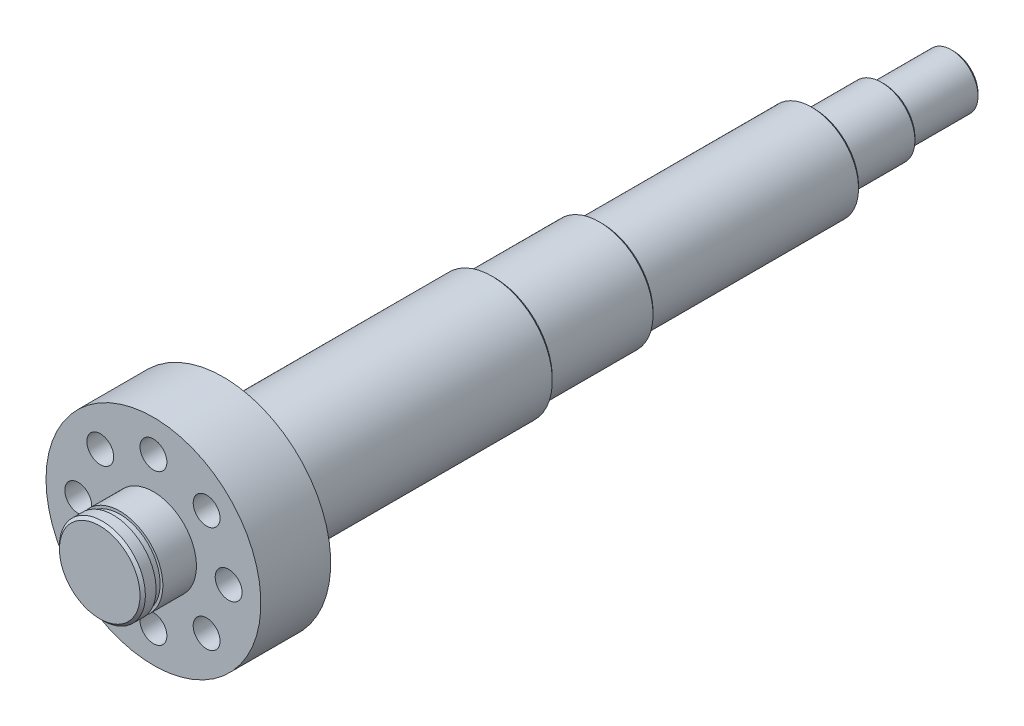
ISO-10303-21;
HEADER;
FILE_DESCRIPTION(('STEP AP214'),'2;1');
FILE_NAME('part.step','',(''),(''),'','','');
FILE_SCHEMA(('AUTOMOTIVE_DESIGN { 1 0 10303 214 1 1 1 1 }'));
ENDSEC;
DATA;
#1=APPLICATION_CONTEXT('core data for automotive mechanical design processes');
#2=APPLICATION_PROTOCOL_DEFINITION('international standard','automotive_design',2000,#1);
#3=PRODUCT_CONTEXT('',#1,'mechanical');
#4=PRODUCT('Part','Part','',(#3));
#5=PRODUCT_RELATED_PRODUCT_CATEGORY('part','',(#4));
#6=PRODUCT_DEFINITION_FORMATION('','',#4);
#7=PRODUCT_DEFINITION_CONTEXT('part definition',#1,'design');
#8=PRODUCT_DEFINITION('design','',#6,#7);
#9=PRODUCT_DEFINITION_SHAPE('','',#8);
#10=(LENGTH_UNIT() NAMED_UNIT(*) SI_UNIT(.MILLI.,.METRE.));
#11=(NAMED_UNIT(*) PLANE_ANGLE_UNIT() SI_UNIT($,.RADIAN.));
#12=(NAMED_UNIT(*) SI_UNIT($,.STERADIAN.) SOLID_ANGLE_UNIT());
#13=UNCERTAINTY_MEASURE_WITH_UNIT(LENGTH_MEASURE(1.E-05),#10,'distance_accuracy_value','');
#14=(GEOMETRIC_REPRESENTATION_CONTEXT(3) GLOBAL_UNCERTAINTY_ASSIGNED_CONTEXT((#13)) GLOBAL_UNIT_ASSIGNED_CONTEXT((#10,
#11,#12)) REPRESENTATION_CONTEXT('',''));
#15=CARTESIAN_POINT('',(0.,0.,0.));
#16=DIRECTION('',(0.,0.,1.));
#17=DIRECTION('',(1.,0.,0.));
#18=AXIS2_PLACEMENT_3D('',#15,#16,#17);
#19=CARTESIAN_POINT('',(0.,0.,-272.));
#20=DIRECTION('',(0.,0.,-1.));
#21=DIRECTION('',(-1.,0.,0.));
#22=AXIS2_PLACEMENT_3D('',#19,#20,#21);
#23=PLANE('',#22);
#24=CARTESIAN_POINT('',(0.,0.,-272.));
#25=DIRECTION('',(0.,0.,-1.));
#26=DIRECTION('',(-1.,0.,0.));
#27=AXIS2_PLACEMENT_3D('',#24,#25,#26);
#28=CIRCLE('',#27,11.5000000000001);
#29=CARTESIAN_POINT('',(-11.5000000000001,0.,-272.));
#30=VERTEX_POINT('',#29);
#31=EDGE_CURVE('E59',#30,#30,#28,.T.);
#32=ORIENTED_EDGE('',*,*,#31,.T.);
#33=EDGE_LOOP('',(#32));
#34=FACE_BOUND('',#33,.T.);
#35=CARTESIAN_POINT('',(0.,0.,-272.));
#36=DIRECTION('',(0.,0.,-1.));
#37=DIRECTION('',(-1.,0.,0.));
#38=AXIS2_PLACEMENT_3D('',#35,#36,#37);
#39=CIRCLE('',#38,10.);
#40=CARTESIAN_POINT('',(-10.,0.,-272.));
#41=VERTEX_POINT('',#40);
#42=EDGE_CURVE('E155',#41,#41,#39,.T.);
#43=ORIENTED_EDGE('',*,*,#42,.F.);
#44=EDGE_LOOP('',(#43));
#45=FACE_BOUND('',#44,.T.);
#46=ADVANCED_FACE('F30',(#34,#45),#23,.T.);
#47=CARTESIAN_POINT('',(0.,0.,-246.));
#48=DIRECTION('',(0.,0.,-1.));
#49=DIRECTION('',(-1.,0.,0.));
#50=AXIS2_PLACEMENT_3D('',#47,#48,#49);
#51=PLANE('',#50);
#52=CARTESIAN_POINT('',(0.,0.,-246.));
#53=DIRECTION('',(0.,0.,-1.));
#54=DIRECTION('',(-1.,0.,0.));
#55=AXIS2_PLACEMENT_3D('',#52,#53,#54);
#56=CIRCLE('',#55,16.5);
#57=CARTESIAN_POINT('',(-16.5,0.,-246.));
#58=VERTEX_POINT('',#57);
#59=EDGE_CURVE('E53',#58,#58,#56,.T.);
#60=ORIENTED_EDGE('',*,*,#59,.T.);
#61=EDGE_LOOP('',(#60));
#62=FACE_BOUND('',#61,.T.);
#63=CARTESIAN_POINT('',(0.,0.,-246.));
#64=DIRECTION('',(0.,0.,-1.));
#65=DIRECTION('',(-1.,0.,0.));
#66=AXIS2_PLACEMENT_3D('',#63,#64,#65);
#67=CIRCLE('',#66,12.5);
#68=CARTESIAN_POINT('',(-12.5,0.,-246.));
#69=VERTEX_POINT('',#68);
#70=EDGE_CURVE('E152',#69,#69,#67,.T.);
#71=ORIENTED_EDGE('',*,*,#70,.F.);
#72=EDGE_LOOP('',(#71));
#73=FACE_BOUND('',#72,.T.);
#74=ADVANCED_FACE('F203',(#62,#73),#51,.T.);
#75=CARTESIAN_POINT('',(0.,0.,-167.));
#76=DIRECTION('',(0.,0.,-1.));
#77=DIRECTION('',(-1.,0.,0.));
#78=AXIS2_PLACEMENT_3D('',#75,#76,#77);
#79=PLANE('',#78);
#80=CARTESIAN_POINT('',(0.,0.,-167.));
#81=DIRECTION('',(0.,0.,-1.));
#82=DIRECTION('',(-1.,0.,0.));
#83=AXIS2_PLACEMENT_3D('',#80,#81,#82);
#84=CIRCLE('',#83,19.);
#85=CARTESIAN_POINT('',(-19.,0.,-167.));
#86=VERTEX_POINT('',#85);
#87=EDGE_CURVE('E45',#86,#86,#84,.T.);
#88=ORIENTED_EDGE('',*,*,#87,.T.);
#89=EDGE_LOOP('',(#88));
#90=FACE_BOUND('',#89,.T.);
#91=CARTESIAN_POINT('',(0.,0.,-167.));
#92=DIRECTION('',(0.,0.,-1.));
#93=DIRECTION('',(-1.,0.,0.));
#94=AXIS2_PLACEMENT_3D('',#91,#92,#93);
#95=CIRCLE('',#94,17.5);
#96=CARTESIAN_POINT('',(-17.5,0.,-167.));
#97=VERTEX_POINT('',#96);
#98=EDGE_CURVE('E149',#97,#97,#95,.T.);
#99=ORIENTED_EDGE('',*,*,#98,.F.);
#100=EDGE_LOOP('',(#99));
#101=FACE_BOUND('',#100,.T.);
#102=ADVANCED_FACE('F209',(#90,#101),#79,.T.);
#103=CARTESIAN_POINT('',(0.,0.,-127.));
#104=DIRECTION('',(0.,0.,-1.));
#105=DIRECTION('',(-1.,0.,0.));
#106=AXIS2_PLACEMENT_3D('',#103,#104,#105);
#107=PLANE('',#106);
#108=CARTESIAN_POINT('',(0.,0.,-127.));
#109=DIRECTION('',(0.,0.,-1.));
#110=DIRECTION('',(-1.,0.,0.));
#111=AXIS2_PLACEMENT_3D('',#108,#109,#110);
#112=CIRCLE('',#111,21.4999999999999);
#113=CARTESIAN_POINT('',(-21.4999999999999,0.,-127.));
#114=VERTEX_POINT('',#113);
#115=EDGE_CURVE('E37',#114,#114,#112,.T.);
#116=ORIENTED_EDGE('',*,*,#115,.T.);
#117=EDGE_LOOP('',(#116));
#118=FACE_BOUND('',#117,.T.);
#119=CARTESIAN_POINT('',(0.,0.,-127.));
#120=DIRECTION('',(0.,0.,-1.));
#121=DIRECTION('',(-1.,0.,0.));
#122=AXIS2_PLACEMENT_3D('',#119,#120,#121);
#123=CIRCLE('',#122,20.);
#124=CARTESIAN_POINT('',(-20.,0.,-127.));
#125=VERTEX_POINT('',#124);
#126=EDGE_CURVE('E146',#125,#125,#123,.T.);
#127=ORIENTED_EDGE('',*,*,#126,.F.);
#128=EDGE_LOOP('',(#127));
#129=FACE_BOUND('',#128,.T.);
#130=ADVANCED_FACE('F226',(#118,#129),#107,.T.);
#131=CARTESIAN_POINT('',(0.,0.,-26.));
#132=DIRECTION('',(0.,0.,-1.));
#133=DIRECTION('',(-1.,0.,0.));
#134=AXIS2_PLACEMENT_3D('',#131,#132,#133);
#135=PLANE('',#134);
#136=CARTESIAN_POINT('',(0.,0.,-26.));
#137=DIRECTION('',(0.,0.,-1.));
#138=DIRECTION('',(-1.,0.,0.));
#139=AXIS2_PLACEMENT_3D('',#136,#137,#138);
#140=CIRCLE('',#139,40.);
#141=CARTESIAN_POINT('',(-40.,0.,-26.));
#142=VERTEX_POINT('',#141);
#143=EDGE_CURVE('E77',#142,#142,#140,.T.);
#144=ORIENTED_EDGE('',*,*,#143,.T.);
#145=EDGE_LOOP('',(#144));
#146=FACE_BOUND('',#145,.T.);
#147=CARTESIAN_POINT('',(0.,0.,-26.));
#148=DIRECTION('',(0.,0.,-1.));
#149=DIRECTION('',(-1.,0.,0.));
#150=AXIS2_PLACEMENT_3D('',#147,#148,#149);
#151=CIRCLE('',#150,22.5);
#152=CARTESIAN_POINT('',(-22.5,0.,-26.));
#153=VERTEX_POINT('',#152);
#154=EDGE_CURVE('E141',#153,#153,#151,.T.);
#155=ORIENTED_EDGE('',*,*,#154,.F.);
#156=EDGE_LOOP('',(#155));
#157=FACE_BOUND('',#156,.T.);
#158=ADVANCED_FACE('F234',(#146,#157),#135,.T.);
#159=CARTESIAN_POINT('',(0.,0.,20.));
#160=DIRECTION('',(0.,0.,-1.));
#161=DIRECTION('',(-1.,0.,0.));
#162=AXIS2_PLACEMENT_3D('',#159,#160,#161);
#163=CYLINDRICAL_SURFACE('',#162,16.);
#164=CARTESIAN_POINT('',(0.,0.,0.));
#165=DIRECTION('',(0.,0.,-1.));
#166=DIRECTION('',(-1.,0.,0.));
#167=AXIS2_PLACEMENT_3D('',#164,#165,#166);
#168=CIRCLE('',#167,16.);
#169=CARTESIAN_POINT('',(-16.,0.,0.));
#170=VERTEX_POINT('',#169);
#171=EDGE_CURVE('E74',#170,#170,#168,.T.);
#172=ORIENTED_EDGE('',*,*,#171,.F.);
#173=EDGE_LOOP('',(#172));
#174=FACE_BOUND('',#173,.T.);
#175=CARTESIAN_POINT('',(0.,0.,12.5));
#176=DIRECTION('',(0.,0.,-1.));
#177=DIRECTION('',(-1.,0.,0.));
#178=AXIS2_PLACEMENT_3D('',#175,#176,#177);
#179=CIRCLE('',#178,16.);
#180=CARTESIAN_POINT('',(-16.,0.,12.5));
#181=VERTEX_POINT('',#180);
#182=EDGE_CURVE('E92',#181,#181,#179,.T.);
#183=ORIENTED_EDGE('',*,*,#182,.T.);
#184=EDGE_LOOP('',(#183));
#185=FACE_BOUND('',#184,.T.);
#186=ADVANCED_FACE('F319',(#174,#185),#163,.T.);
#187=CARTESIAN_POINT('',(0.,0.,0.));
#188=DIRECTION('',(0.,0.,-1.));
#189=DIRECTION('',(-1.,0.,0.));
#190=AXIS2_PLACEMENT_3D('',#187,#188,#189);
#191=PLANE('',#190);
#192=CARTESIAN_POINT('',(19.7989898732236,-19.7989898732231,0.));
#193=DIRECTION('',(0.,0.,1.));
#194=DIRECTION('',(0.707106781186556,-0.707106781186539,0.));
#195=AXIS2_PLACEMENT_3D('',#192,#193,#194);
#196=CIRCLE('',#195,5.);
#197=CARTESIAN_POINT('',(23.3345237791564,-23.3345237791558,0.));
#198=VERTEX_POINT('',#197);
#199=EDGE_CURVE('E138',#198,#198,#196,.T.);
#200=ORIENTED_EDGE('',*,*,#199,.F.);
#201=EDGE_LOOP('',(#200));
#202=FACE_BOUND('',#201,.T.);
#203=CARTESIAN_POINT('',(2.93284602333188E-13,-28.,0.));
#204=DIRECTION('',(0.,0.,1.));
#205=DIRECTION('',(0.,-1.,0.));
#206=AXIS2_PLACEMENT_3D('',#203,#204,#205);
#207=CIRCLE('',#206,5.);
#208=CARTESIAN_POINT('',(3.45656852749829E-13,-33.,0.));
#209=VERTEX_POINT('',#208);
#210=EDGE_CURVE('E132',#209,#209,#207,.T.);
#211=ORIENTED_EDGE('',*,*,#210,.F.);
#212=EDGE_LOOP('',(#211));
#213=FACE_BOUND('',#212,.T.);
#214=CARTESIAN_POINT('',(-19.7989898732232,-19.7989898732235,0.));
#215=DIRECTION('',(0.,0.,1.));
#216=DIRECTION('',(-0.707106781186541,-0.707106781186554,0.));
#217=AXIS2_PLACEMENT_3D('',#214,#215,#216);
#218=CIRCLE('',#217,5.);
#219=CARTESIAN_POINT('',(-23.3345237791559,-23.3345237791563,0.));
#220=VERTEX_POINT('',#219);
#221=EDGE_CURVE('E126',#220,#220,#218,.T.);
#222=ORIENTED_EDGE('',*,*,#221,.F.);
#223=EDGE_LOOP('',(#222));
#224=FACE_BOUND('',#223,.T.);
#225=CARTESIAN_POINT('',(-28.,0.,0.));
#226=DIRECTION('',(0.,0.,1.));
#227=DIRECTION('',(-1.,0.,0.));
#228=AXIS2_PLACEMENT_3D('',#225,#226,#227);
#229=CIRCLE('',#228,5.);
#230=CARTESIAN_POINT('',(-33.,0.,0.));
#231=VERTEX_POINT('',#230);
#232=EDGE_CURVE('E120',#231,#231,#229,.T.);
#233=ORIENTED_EDGE('',*,*,#232,.F.);
#234=EDGE_LOOP('',(#233));
#235=FACE_BOUND('',#234,.T.);
#236=CARTESIAN_POINT('',(-19.7989898732234,19.7989898732232,0.));
#237=DIRECTION('',(0.,0.,1.));
#238=DIRECTION('',(-0.707106781186551,0.707106781186544,0.));
#239=AXIS2_PLACEMENT_3D('',#236,#237,#238);
#240=CIRCLE('',#239,5.);
#241=CARTESIAN_POINT('',(-23.3345237791562,23.3345237791559,0.));
#242=VERTEX_POINT('',#241);
#243=EDGE_CURVE('E114',#242,#242,#240,.T.);
#244=ORIENTED_EDGE('',*,*,#243,.F.);
#245=EDGE_LOOP('',(#244));
#246=FACE_BOUND('',#245,.T.);
#247=CARTESIAN_POINT('',(0.,28.,0.));
#248=DIRECTION('',(0.,0.,1.));
#249=DIRECTION('',(0.,1.,0.));
#250=AXIS2_PLACEMENT_3D('',#247,#248,#249);
#251=CIRCLE('',#250,5.);
#252=CARTESIAN_POINT('',(-1.1521895091661E-13,33.,0.));
#253=VERTEX_POINT('',#252);
#254=EDGE_CURVE('E108',#253,#253,#251,.T.);
#255=ORIENTED_EDGE('',*,*,#254,.F.);
#256=EDGE_LOOP('',(#255));
#257=FACE_BOUND('',#256,.T.);
#258=CARTESIAN_POINT('',(19.7989898732233,19.7989898732234,0.));
#259=DIRECTION('',(0.,0.,1.));
#260=DIRECTION('',(0.707106781186546,0.707106781186549,0.));
#261=AXIS2_PLACEMENT_3D('',#258,#259,#260);
#262=CIRCLE('',#261,5.);
#263=CARTESIAN_POINT('',(23.334523779156,23.3345237791561,0.));
#264=VERTEX_POINT('',#263);
#265=EDGE_CURVE('E102',#264,#264,#262,.T.);
#266=ORIENTED_EDGE('',*,*,#265,.F.);
#267=EDGE_LOOP('',(#266));
#268=FACE_BOUND('',#267,.T.);
#269=CARTESIAN_POINT('',(28.,0.,0.));
#270=DIRECTION('',(0.,0.,1.));
#271=DIRECTION('',(1.,0.,0.));
#272=AXIS2_PLACEMENT_3D('',#269,#270,#271);
#273=CIRCLE('',#272,5.);
#274=CARTESIAN_POINT('',(33.,0.,0.));
#275=VERTEX_POINT('',#274);
#276=EDGE_CURVE('E96',#275,#275,#273,.T.);
#277=ORIENTED_EDGE('',*,*,#276,.F.);
#278=EDGE_LOOP('',(#277));
#279=FACE_BOUND('',#278,.T.);
#280=CARTESIAN_POINT('',(0.,0.,0.));
#281=DIRECTION('',(0.,0.,-1.));
#282=DIRECTION('',(-1.,0.,0.));
#283=AXIS2_PLACEMENT_3D('',#280,#281,#282);
#284=CIRCLE('',#283,40.);
#285=CARTESIAN_POINT('',(-40.,0.,0.));
#286=VERTEX_POINT('',#285);
#287=EDGE_CURVE('E78',#286,#286,#284,.T.);
#288=ORIENTED_EDGE('',*,*,#287,.F.);
#289=EDGE_LOOP('',(#288));
#290=FACE_BOUND('',#289,.T.);
#291=ORIENTED_EDGE('',*,*,#171,.T.);
#292=EDGE_LOOP('',(#291));
#293=FACE_BOUND('',#292,.T.);
#294=ADVANCED_FACE('F321',(#202,#213,#224,#235,#246,#257,#268,#279,#290,#293),#191,.F.);
#295=CARTESIAN_POINT('',(0.,0.,-26.));
#296=DIRECTION('',(0.,0.,1.));
#297=DIRECTION('',(1.,0.,0.));
#298=AXIS2_PLACEMENT_3D('',#295,#296,#297);
#299=CYLINDRICAL_SURFACE('',#298,40.);
#300=ORIENTED_EDGE('',*,*,#143,.F.);
#301=EDGE_LOOP('',(#300));
#302=FACE_BOUND('',#301,.T.);
#303=ORIENTED_EDGE('',*,*,#287,.T.);
#304=EDGE_LOOP('',(#303));
#305=FACE_BOUND('',#304,.T.);
#306=ADVANCED_FACE('F315',(#302,#305),#299,.T.);
#307=CARTESIAN_POINT('',(16.,0.,15.));
#308=DIRECTION('',(0.,0.,-1.));
#309=DIRECTION('',(-1.,0.,0.));
#310=AXIS2_PLACEMENT_3D('',#307,#308,#309);
#311=PLANE('',#310);
#312=CARTESIAN_POINT('',(0.,0.,15.));
#313=DIRECTION('',(0.,0.,-1.));
#314=DIRECTION('',(-1.,0.,0.));
#315=AXIS2_PLACEMENT_3D('',#312,#313,#314);
#316=CIRCLE('',#315,16.);
#317=CARTESIAN_POINT('',(-16.,0.,15.));
#318=VERTEX_POINT('',#317);
#319=EDGE_CURVE('E81',#318,#318,#316,.T.);
#320=ORIENTED_EDGE('',*,*,#319,.T.);
#321=EDGE_LOOP('',(#320));
#322=FACE_BOUND('',#321,.T.);
#323=CARTESIAN_POINT('',(0.,0.,15.));
#324=DIRECTION('',(0.,0.,-1.));
#325=DIRECTION('',(-1.,0.,0.));
#326=AXIS2_PLACEMENT_3D('',#323,#324,#325);
#327=CIRCLE('',#326,15.);
#328=CARTESIAN_POINT('',(-15.,0.,15.));
#329=VERTEX_POINT('',#328);
#330=EDGE_CURVE('E86',#329,#329,#327,.T.);
#331=ORIENTED_EDGE('',*,*,#330,.F.);
#332=EDGE_LOOP('',(#331));
#333=FACE_BOUND('',#332,.T.);
#334=ADVANCED_FACE('F311',(#322,#333),#311,.T.);
#335=CARTESIAN_POINT('',(0.,0.,0.));
#336=DIRECTION('',(0.,0.,-1.));
#337=DIRECTION('',(-1.,0.,0.));
#338=AXIS2_PLACEMENT_3D('',#335,#336,#337);
#339=CYLINDRICAL_SURFACE('',#338,15.);
#340=ORIENTED_EDGE('',*,*,#330,.T.);
#341=EDGE_LOOP('',(#340));
#342=FACE_BOUND('',#341,.T.);
#343=CARTESIAN_POINT('',(0.,0.,12.5));
#344=DIRECTION('',(0.,0.,-1.));
#345=DIRECTION('',(-1.,0.,0.));
#346=AXIS2_PLACEMENT_3D('',#343,#344,#345);
#347=CIRCLE('',#346,15.);
#348=CARTESIAN_POINT('',(-15.,0.,12.5));
#349=VERTEX_POINT('',#348);
#350=EDGE_CURVE('E89',#349,#349,#347,.T.);
#351=ORIENTED_EDGE('',*,*,#350,.F.);
#352=EDGE_LOOP('',(#351));
#353=FACE_BOUND('',#352,.T.);
#354=ADVANCED_FACE('F307',(#342,#353),#339,.T.);
#355=CARTESIAN_POINT('',(16.,0.,12.5));
#356=DIRECTION('',(0.,0.,1.));
#357=DIRECTION('',(1.,0.,0.));
#358=AXIS2_PLACEMENT_3D('',#355,#356,#357);
#359=PLANE('',#358);
#360=ORIENTED_EDGE('',*,*,#350,.T.);
#361=EDGE_LOOP('',(#360));
#362=FACE_BOUND('',#361,.T.);
#363=ORIENTED_EDGE('',*,*,#182,.F.);
#364=EDGE_LOOP('',(#363));
#365=FACE_BOUND('',#364,.T.);
#366=ADVANCED_FACE('F303',(#362,#365),#359,.T.);
#367=CARTESIAN_POINT('',(0.,0.,20.));
#368=DIRECTION('',(0.,0.,1.));
#369=DIRECTION('',(1.,0.,0.));
#370=AXIS2_PLACEMENT_3D('',#367,#368,#369);
#371=PLANE('',#370);
#372=CARTESIAN_POINT('',(0.,0.,20.));
#373=DIRECTION('',(0.,0.,1.));
#374=DIRECTION('',(1.,0.,0.));
#375=AXIS2_PLACEMENT_3D('',#372,#373,#374);
#376=CIRCLE('',#375,15.);
#377=CARTESIAN_POINT('',(15.,0.,20.));
#378=VERTEX_POINT('',#377);
#379=EDGE_CURVE('E71',#378,#378,#376,.T.);
#380=ORIENTED_EDGE('',*,*,#379,.T.);
#381=EDGE_LOOP('',(#380));
#382=FACE_BOUND('',#381,.T.);
#383=ADVANCED_FACE('F306',(#382),#371,.T.);
#384=CARTESIAN_POINT('',(0.,0.,19.));
#385=DIRECTION('',(0.,0.,1.));
#386=DIRECTION('',(1.,0.,0.));
#387=AXIS2_PLACEMENT_3D('',#384,#385,#386);
#388=CIRCLE('',#387,16.);
#389=CARTESIAN_POINT('',(16.,0.,19.));
#390=VERTEX_POINT('',#389);
#391=EDGE_CURVE('E68',#390,#390,#388,.F.);
#392=ORIENTED_EDGE('',*,*,#391,.T.);
#393=EDGE_LOOP('',(#392));
#394=FACE_BOUND('',#393,.T.);
#395=ORIENTED_EDGE('',*,*,#319,.F.);
#396=EDGE_LOOP('',(#395));
#397=FACE_BOUND('',#396,.T.);
#398=ADVANCED_FACE('F301',(#394,#397),#163,.T.);
#399=CARTESIAN_POINT('',(28.,0.,-8.));
#400=DIRECTION('',(0.,0.,1.));
#401=DIRECTION('',(1.,0.,0.));
#402=AXIS2_PLACEMENT_3D('',#399,#400,#401);
#403=CYLINDRICAL_SURFACE('',#402,5.);
#404=CARTESIAN_POINT('',(28.,0.,-8.));
#405=DIRECTION('',(0.,0.,1.));
#406=DIRECTION('',(1.,0.,0.));
#407=AXIS2_PLACEMENT_3D('',#404,#405,#406);
#408=CIRCLE('',#407,5.);
#409=CARTESIAN_POINT('',(33.,0.,-8.));
#410=VERTEX_POINT('',#409);
#411=EDGE_CURVE('E95',#410,#410,#408,.T.);
#412=ORIENTED_EDGE('',*,*,#411,.F.);
#413=EDGE_LOOP('',(#412));
#414=FACE_BOUND('',#413,.T.);
#415=ORIENTED_EDGE('',*,*,#276,.T.);
#416=EDGE_LOOP('',(#415));
#417=FACE_BOUND('',#416,.T.);
#418=ADVANCED_FACE('F297',(#414,#417),#403,.F.);
#419=CARTESIAN_POINT('',(28.,0.,-8.));
#420=DIRECTION('',(0.,0.,1.));
#421=DIRECTION('',(1.,0.,0.));
#422=AXIS2_PLACEMENT_3D('',#419,#420,#421);
#423=PLANE('',#422);
#424=ORIENTED_EDGE('',*,*,#411,.T.);
#425=EDGE_LOOP('',(#424));
#426=FACE_BOUND('',#425,.T.);
#427=ADVANCED_FACE('F293',(#426),#423,.T.);
#428=CARTESIAN_POINT('',(19.7989898732233,19.7989898732234,-8.));
#429=DIRECTION('',(0.,0.,1.));
#430=DIRECTION('',(1.,0.,0.));
#431=AXIS2_PLACEMENT_3D('',#428,#429,#430);
#432=CYLINDRICAL_SURFACE('',#431,5.);
#433=CARTESIAN_POINT('',(19.7989898732233,19.7989898732234,-8.));
#434=DIRECTION('',(0.,0.,1.));
#435=DIRECTION('',(0.707106781186546,0.707106781186549,0.));
#436=AXIS2_PLACEMENT_3D('',#433,#434,#435);
#437=CIRCLE('',#436,5.);
#438=CARTESIAN_POINT('',(23.334523779156,23.3345237791561,-8.));
#439=VERTEX_POINT('',#438);
#440=EDGE_CURVE('E99',#439,#439,#437,.T.);
#441=ORIENTED_EDGE('',*,*,#440,.F.);
#442=EDGE_LOOP('',(#441));
#443=FACE_BOUND('',#442,.T.);
#444=ORIENTED_EDGE('',*,*,#265,.T.);
#445=EDGE_LOOP('',(#444));
#446=FACE_BOUND('',#445,.T.);
#447=ADVANCED_FACE('F289',(#443,#446),#432,.F.);
#448=CARTESIAN_POINT('',(19.7989898732233,19.7989898732234,-8.));
#449=DIRECTION('',(0.,0.,1.));
#450=DIRECTION('',(0.707106781186546,0.707106781186549,0.));
#451=AXIS2_PLACEMENT_3D('',#448,#449,#450);
#452=PLANE('',#451);
#453=ORIENTED_EDGE('',*,*,#440,.T.);
#454=EDGE_LOOP('',(#453));
#455=FACE_BOUND('',#454,.T.);
#456=ADVANCED_FACE('F285',(#455),#452,.T.);
#457=CARTESIAN_POINT('',(0.,28.,-8.));
#458=DIRECTION('',(0.,0.,1.));
#459=DIRECTION('',(1.,0.,0.));
#460=AXIS2_PLACEMENT_3D('',#457,#458,#459);
#461=CYLINDRICAL_SURFACE('',#460,5.);
#462=CARTESIAN_POINT('',(0.,28.,-8.));
#463=DIRECTION('',(0.,0.,1.));
#464=DIRECTION('',(0.,1.,0.));
#465=AXIS2_PLACEMENT_3D('',#462,#463,#464);
#466=CIRCLE('',#465,5.);
#467=CARTESIAN_POINT('',(-1.1521895091661E-13,33.,-8.));
#468=VERTEX_POINT('',#467);
#469=EDGE_CURVE('E105',#468,#468,#466,.T.);
#470=ORIENTED_EDGE('',*,*,#469,.F.);
#471=EDGE_LOOP('',(#470));
#472=FACE_BOUND('',#471,.T.);
#473=ORIENTED_EDGE('',*,*,#254,.T.);
#474=EDGE_LOOP('',(#473));
#475=FACE_BOUND('',#474,.T.);
#476=ADVANCED_FACE('F281',(#472,#475),#461,.F.);
#477=CARTESIAN_POINT('',(0.,28.,-8.));
#478=DIRECTION('',(0.,0.,1.));
#479=DIRECTION('',(0.,1.,0.));
#480=AXIS2_PLACEMENT_3D('',#477,#478,#479);
#481=PLANE('',#480);
#482=ORIENTED_EDGE('',*,*,#469,.T.);
#483=EDGE_LOOP('',(#482));
#484=FACE_BOUND('',#483,.T.);
#485=ADVANCED_FACE('F277',(#484),#481,.T.);
#486=CARTESIAN_POINT('',(-19.7989898732234,19.7989898732232,-8.));
#487=DIRECTION('',(0.,0.,1.));
#488=DIRECTION('',(1.,0.,0.));
#489=AXIS2_PLACEMENT_3D('',#486,#487,#488);
#490=CYLINDRICAL_SURFACE('',#489,5.);
#491=CARTESIAN_POINT('',(-19.7989898732234,19.7989898732232,-8.));
#492=DIRECTION('',(0.,0.,1.));
#493=DIRECTION('',(-0.707106781186551,0.707106781186544,0.));
#494=AXIS2_PLACEMENT_3D('',#491,#492,#493);
#495=CIRCLE('',#494,5.);
#496=CARTESIAN_POINT('',(-23.3345237791562,23.3345237791559,-8.));
#497=VERTEX_POINT('',#496);
#498=EDGE_CURVE('E111',#497,#497,#495,.T.);
#499=ORIENTED_EDGE('',*,*,#498,.F.);
#500=EDGE_LOOP('',(#499));
#501=FACE_BOUND('',#500,.T.);
#502=ORIENTED_EDGE('',*,*,#243,.T.);
#503=EDGE_LOOP('',(#502));
#504=FACE_BOUND('',#503,.T.);
#505=ADVANCED_FACE('F273',(#501,#504),#490,.F.);
#506=CARTESIAN_POINT('',(-19.7989898732234,19.7989898732232,-8.));
#507=DIRECTION('',(0.,0.,1.));
#508=DIRECTION('',(-0.707106781186551,0.707106781186544,0.));
#509=AXIS2_PLACEMENT_3D('',#506,#507,#508);
#510=PLANE('',#509);
#511=ORIENTED_EDGE('',*,*,#498,.T.);
#512=EDGE_LOOP('',(#511));
#513=FACE_BOUND('',#512,.T.);
#514=ADVANCED_FACE('F269',(#513),#510,.T.);
#515=CARTESIAN_POINT('',(-28.,0.,-8.));
#516=DIRECTION('',(0.,0.,1.));
#517=DIRECTION('',(1.,0.,0.));
#518=AXIS2_PLACEMENT_3D('',#515,#516,#517);
#519=CYLINDRICAL_SURFACE('',#518,5.);
#520=CARTESIAN_POINT('',(-28.,0.,-8.));
#521=DIRECTION('',(0.,0.,1.));
#522=DIRECTION('',(-1.,0.,0.));
#523=AXIS2_PLACEMENT_3D('',#520,#521,#522);
#524=CIRCLE('',#523,5.);
#525=CARTESIAN_POINT('',(-33.,0.,-8.));
#526=VERTEX_POINT('',#525);
#527=EDGE_CURVE('E117',#526,#526,#524,.T.);
#528=ORIENTED_EDGE('',*,*,#527,.F.);
#529=EDGE_LOOP('',(#528));
#530=FACE_BOUND('',#529,.T.);
#531=ORIENTED_EDGE('',*,*,#232,.T.);
#532=EDGE_LOOP('',(#531));
#533=FACE_BOUND('',#532,.T.);
#534=ADVANCED_FACE('F265',(#530,#533),#519,.F.);
#535=CARTESIAN_POINT('',(-28.,0.,-8.));
#536=DIRECTION('',(0.,0.,1.));
#537=DIRECTION('',(-1.,0.,0.));
#538=AXIS2_PLACEMENT_3D('',#535,#536,#537);
#539=PLANE('',#538);
#540=ORIENTED_EDGE('',*,*,#527,.T.);
#541=EDGE_LOOP('',(#540));
#542=FACE_BOUND('',#541,.T.);
#543=ADVANCED_FACE('F261',(#542),#539,.T.);
#544=CARTESIAN_POINT('',(-19.7989898732232,-19.7989898732235,-8.));
#545=DIRECTION('',(0.,0.,1.));
#546=DIRECTION('',(1.,0.,0.));
#547=AXIS2_PLACEMENT_3D('',#544,#545,#546);
#548=CYLINDRICAL_SURFACE('',#547,5.);
#549=CARTESIAN_POINT('',(-19.7989898732232,-19.7989898732235,-8.));
#550=DIRECTION('',(0.,0.,1.));
#551=DIRECTION('',(-0.707106781186541,-0.707106781186554,0.));
#552=AXIS2_PLACEMENT_3D('',#549,#550,#551);
#553=CIRCLE('',#552,5.);
#554=CARTESIAN_POINT('',(-23.3345237791559,-23.3345237791563,-8.));
#555=VERTEX_POINT('',#554);
#556=EDGE_CURVE('E123',#555,#555,#553,.T.);
#557=ORIENTED_EDGE('',*,*,#556,.F.);
#558=EDGE_LOOP('',(#557));
#559=FACE_BOUND('',#558,.T.);
#560=ORIENTED_EDGE('',*,*,#221,.T.);
#561=EDGE_LOOP('',(#560));
#562=FACE_BOUND('',#561,.T.);
#563=ADVANCED_FACE('F257',(#559,#562),#548,.F.);
#564=CARTESIAN_POINT('',(-19.7989898732232,-19.7989898732235,-8.));
#565=DIRECTION('',(0.,0.,1.));
#566=DIRECTION('',(-0.707106781186541,-0.707106781186554,0.));
#567=AXIS2_PLACEMENT_3D('',#564,#565,#566);
#568=PLANE('',#567);
#569=ORIENTED_EDGE('',*,*,#556,.T.);
#570=EDGE_LOOP('',(#569));
#571=FACE_BOUND('',#570,.T.);
#572=ADVANCED_FACE('F253',(#571),#568,.T.);
#573=CARTESIAN_POINT('',(2.93284602333188E-13,-28.,-8.));
#574=DIRECTION('',(0.,0.,1.));
#575=DIRECTION('',(1.,0.,0.));
#576=AXIS2_PLACEMENT_3D('',#573,#574,#575);
#577=CYLINDRICAL_SURFACE('',#576,5.);
#578=CARTESIAN_POINT('',(2.93284602333188E-13,-28.,-8.));
#579=DIRECTION('',(0.,0.,1.));
#580=DIRECTION('',(0.,-1.,0.));
#581=AXIS2_PLACEMENT_3D('',#578,#579,#580);
#582=CIRCLE('',#581,5.);
#583=CARTESIAN_POINT('',(3.45656852749829E-13,-33.,-8.));
#584=VERTEX_POINT('',#583);
#585=EDGE_CURVE('E129',#584,#584,#582,.T.);
#586=ORIENTED_EDGE('',*,*,#585,.F.);
#587=EDGE_LOOP('',(#586));
#588=FACE_BOUND('',#587,.T.);
#589=ORIENTED_EDGE('',*,*,#210,.T.);
#590=EDGE_LOOP('',(#589));
#591=FACE_BOUND('',#590,.T.);
#592=ADVANCED_FACE('F249',(#588,#591),#577,.F.);
#593=CARTESIAN_POINT('',(2.93284602333188E-13,-28.,-8.));
#594=DIRECTION('',(0.,0.,1.));
#595=DIRECTION('',(0.,-1.,0.));
#596=AXIS2_PLACEMENT_3D('',#593,#594,#595);
#597=PLANE('',#596);
#598=ORIENTED_EDGE('',*,*,#585,.T.);
#599=EDGE_LOOP('',(#598));
#600=FACE_BOUND('',#599,.T.);
#601=ADVANCED_FACE('F245',(#600),#597,.T.);
#602=CARTESIAN_POINT('',(19.7989898732236,-19.7989898732231,-8.));
#603=DIRECTION('',(0.,0.,1.));
#604=DIRECTION('',(1.,0.,0.));
#605=AXIS2_PLACEMENT_3D('',#602,#603,#604);
#606=CYLINDRICAL_SURFACE('',#605,5.);
#607=CARTESIAN_POINT('',(19.7989898732236,-19.7989898732231,-8.));
#608=DIRECTION('',(0.,0.,1.));
#609=DIRECTION('',(0.707106781186556,-0.707106781186539,0.));
#610=AXIS2_PLACEMENT_3D('',#607,#608,#609);
#611=CIRCLE('',#610,5.);
#612=CARTESIAN_POINT('',(23.3345237791564,-23.3345237791558,-8.));
#613=VERTEX_POINT('',#612);
#614=EDGE_CURVE('E135',#613,#613,#611,.T.);
#615=ORIENTED_EDGE('',*,*,#614,.F.);
#616=EDGE_LOOP('',(#615));
#617=FACE_BOUND('',#616,.T.);
#618=ORIENTED_EDGE('',*,*,#199,.T.);
#619=EDGE_LOOP('',(#618));
#620=FACE_BOUND('',#619,.T.);
#621=ADVANCED_FACE('F241',(#617,#620),#606,.F.);
#622=CARTESIAN_POINT('',(19.7989898732236,-19.7989898732231,-8.));
#623=DIRECTION('',(0.,0.,1.));
#624=DIRECTION('',(0.707106781186556,-0.707106781186539,0.));
#625=AXIS2_PLACEMENT_3D('',#622,#623,#624);
#626=PLANE('',#625);
#627=ORIENTED_EDGE('',*,*,#614,.T.);
#628=EDGE_LOOP('',(#627));
#629=FACE_BOUND('',#628,.T.);
#630=ADVANCED_FACE('F238',(#629),#626,.T.);
#631=CARTESIAN_POINT('',(0.,0.,20.));
#632=DIRECTION('',(0.,0.,-1.));
#633=DIRECTION('',(-1.,0.,0.));
#634=AXIS2_PLACEMENT_3D('',#631,#632,#633);
#635=CONICAL_SURFACE('',#634,15.,0.785398163397443);
#636=ORIENTED_EDGE('',*,*,#391,.F.);
#637=EDGE_LOOP('',(#636));
#638=FACE_BOUND('',#637,.T.);
#639=ORIENTED_EDGE('',*,*,#379,.F.);
#640=EDGE_LOOP('',(#639));
#641=FACE_BOUND('',#640,.T.);
#642=ADVANCED_FACE('F237',(#638,#641),#635,.T.);
#643=CARTESIAN_POINT('',(0.,0.,-127.));
#644=DIRECTION('',(0.,0.,1.));
#645=DIRECTION('',(1.,0.,0.));
#646=AXIS2_PLACEMENT_3D('',#643,#644,#645);
#647=CYLINDRICAL_SURFACE('',#646,22.5);
#648=CARTESIAN_POINT('',(0.,0.,-126.));
#649=DIRECTION('',(0.,0.,-1.));
#650=DIRECTION('',(-1.,0.,0.));
#651=AXIS2_PLACEMENT_3D('',#648,#649,#650);
#652=CIRCLE('',#651,22.5);
#653=CARTESIAN_POINT('',(-22.5,0.,-126.));
#654=VERTEX_POINT('',#653);
#655=EDGE_CURVE('E10',#654,#654,#652,.F.);
#656=ORIENTED_EDGE('',*,*,#655,.T.);
#657=EDGE_LOOP('',(#656));
#658=FACE_BOUND('',#657,.T.);
#659=ORIENTED_EDGE('',*,*,#154,.T.);
#660=EDGE_LOOP('',(#659));
#661=FACE_BOUND('',#660,.T.);
#662=ADVANCED_FACE('F230',(#658,#661),#647,.T.);
#663=CARTESIAN_POINT('',(0.,0.,-167.));
#664=DIRECTION('',(0.,0.,1.));
#665=DIRECTION('',(1.,0.,0.));
#666=AXIS2_PLACEMENT_3D('',#663,#664,#665);
#667=CYLINDRICAL_SURFACE('',#666,20.);
#668=CARTESIAN_POINT('',(0.,0.,-166.));
#669=DIRECTION('',(0.,0.,-1.));
#670=DIRECTION('',(-1.,0.,0.));
#671=AXIS2_PLACEMENT_3D('',#668,#669,#670);
#672=CIRCLE('',#671,20.);
#673=CARTESIAN_POINT('',(-20.,0.,-166.));
#674=VERTEX_POINT('',#673);
#675=EDGE_CURVE('E41',#674,#674,#672,.F.);
#676=ORIENTED_EDGE('',*,*,#675,.T.);
#677=EDGE_LOOP('',(#676));
#678=FACE_BOUND('',#677,.T.);
#679=ORIENTED_EDGE('',*,*,#126,.T.);
#680=EDGE_LOOP('',(#679));
#681=FACE_BOUND('',#680,.T.);
#682=ADVANCED_FACE('F222',(#678,#681),#667,.T.);
#683=CARTESIAN_POINT('',(0.,0.,-246.));
#684=DIRECTION('',(0.,0.,1.));
#685=DIRECTION('',(1.,0.,0.));
#686=AXIS2_PLACEMENT_3D('',#683,#684,#685);
#687=CYLINDRICAL_SURFACE('',#686,17.5);
#688=CARTESIAN_POINT('',(0.,0.,-245.));
#689=DIRECTION('',(0.,0.,-1.));
#690=DIRECTION('',(-1.,0.,0.));
#691=AXIS2_PLACEMENT_3D('',#688,#689,#690);
#692=CIRCLE('',#691,17.5);
#693=CARTESIAN_POINT('',(-17.5,0.,-245.));
#694=VERTEX_POINT('',#693);
#695=EDGE_CURVE('E50',#694,#694,#692,.F.);
#696=ORIENTED_EDGE('',*,*,#695,.T.);
#697=EDGE_LOOP('',(#696));
#698=FACE_BOUND('',#697,.T.);
#699=ORIENTED_EDGE('',*,*,#98,.T.);
#700=EDGE_LOOP('',(#699));
#701=FACE_BOUND('',#700,.T.);
#702=ADVANCED_FACE('F217',(#698,#701),#687,.T.);
#703=CARTESIAN_POINT('',(0.,0.,-272.));
#704=DIRECTION('',(0.,0.,1.));
#705=DIRECTION('',(1.,0.,0.));
#706=AXIS2_PLACEMENT_3D('',#703,#704,#705);
#707=CYLINDRICAL_SURFACE('',#706,12.5);
#708=CARTESIAN_POINT('',(0.,0.,-271.));
#709=DIRECTION('',(0.,0.,-1.));
#710=DIRECTION('',(-1.,0.,0.));
#711=AXIS2_PLACEMENT_3D('',#708,#709,#710);
#712=CIRCLE('',#711,12.5);
#713=CARTESIAN_POINT('',(-12.5,0.,-271.));
#714=VERTEX_POINT('',#713);
#715=EDGE_CURVE('E56',#714,#714,#712,.F.);
#716=ORIENTED_EDGE('',*,*,#715,.T.);
#717=EDGE_LOOP('',(#716));
#718=FACE_BOUND('',#717,.T.);
#719=ORIENTED_EDGE('',*,*,#70,.T.);
#720=EDGE_LOOP('',(#719));
#721=FACE_BOUND('',#720,.T.);
#722=ADVANCED_FACE('F215',(#718,#721),#707,.T.);
#723=CARTESIAN_POINT('',(0.,0.,-298.));
#724=DIRECTION('',(0.,0.,1.));
#725=DIRECTION('',(1.,0.,0.));
#726=AXIS2_PLACEMENT_3D('',#723,#724,#725);
#727=CYLINDRICAL_SURFACE('',#726,10.);
#728=CARTESIAN_POINT('',(0.,0.,-297.));
#729=DIRECTION('',(0.,0.,-1.));
#730=DIRECTION('',(-1.,0.,0.));
#731=AXIS2_PLACEMENT_3D('',#728,#729,#730);
#732=CIRCLE('',#731,10.);
#733=CARTESIAN_POINT('',(-10.,0.,-297.));
#734=VERTEX_POINT('',#733);
#735=EDGE_CURVE('E62',#734,#734,#732,.F.);
#736=ORIENTED_EDGE('',*,*,#735,.T.);
#737=EDGE_LOOP('',(#736));
#738=FACE_BOUND('',#737,.T.);
#739=ORIENTED_EDGE('',*,*,#42,.T.);
#740=EDGE_LOOP('',(#739));
#741=FACE_BOUND('',#740,.T.);
#742=ADVANCED_FACE('F184',(#738,#741),#727,.T.);
#743=CARTESIAN_POINT('',(0.,0.,-298.));
#744=DIRECTION('',(0.,0.,-1.));
#745=DIRECTION('',(-1.,0.,0.));
#746=AXIS2_PLACEMENT_3D('',#743,#744,#745);
#747=PLANE('',#746);
#748=CARTESIAN_POINT('',(-6.,0.,-298.));
#749=DIRECTION('',(0.,0.,-1.));
#750=DIRECTION('',(-1.,0.,0.));
#751=AXIS2_PLACEMENT_3D('',#748,#749,#750);
#752=CIRCLE('',#751,2.5);
#753=CARTESIAN_POINT('',(-8.5,0.,-298.));
#754=VERTEX_POINT('',#753);
#755=EDGE_CURVE('E165',#754,#754,#752,.T.);
#756=ORIENTED_EDGE('',*,*,#755,.F.);
#757=EDGE_LOOP('',(#756));
#758=FACE_BOUND('',#757,.T.);
#759=CARTESIAN_POINT('',(6.,0.241348190387259,-298.));
#760=DIRECTION('',(0.,0.,-1.));
#761=DIRECTION('',(-1.,0.,0.));
#762=AXIS2_PLACEMENT_3D('',#759,#760,#761);
#763=CIRCLE('',#762,2.5);
#764=CARTESIAN_POINT('',(3.5,0.241348190387259,-298.));
#765=VERTEX_POINT('',#764);
#766=EDGE_CURVE('E159',#765,#765,#763,.T.);
#767=ORIENTED_EDGE('',*,*,#766,.F.);
#768=EDGE_LOOP('',(#767));
#769=FACE_BOUND('',#768,.T.);
#770=CARTESIAN_POINT('',(0.,0.,-298.));
#771=DIRECTION('',(0.,0.,-1.));
#772=DIRECTION('',(-1.,0.,0.));
#773=AXIS2_PLACEMENT_3D('',#770,#771,#772);
#774=CIRCLE('',#773,9.00000000000017);
#775=CARTESIAN_POINT('',(-9.00000000000017,0.,-298.));
#776=VERTEX_POINT('',#775);
#777=EDGE_CURVE('E65',#776,#776,#774,.T.);
#778=ORIENTED_EDGE('',*,*,#777,.T.);
#779=EDGE_LOOP('',(#778));
#780=FACE_BOUND('',#779,.T.);
#781=ADVANCED_FACE('F180',(#758,#769,#780),#747,.T.);
#782=CARTESIAN_POINT('',(0.,0.,-298.));
#783=DIRECTION('',(0.,0.,1.));
#784=DIRECTION('',(1.,0.,0.));
#785=AXIS2_PLACEMENT_3D('',#782,#783,#784);
#786=CONICAL_SURFACE('',#785,9.00000000000017,0.785398163397473);
#787=ORIENTED_EDGE('',*,*,#735,.F.);
#788=EDGE_LOOP('',(#787));
#789=FACE_BOUND('',#788,.T.);
#790=ORIENTED_EDGE('',*,*,#777,.F.);
#791=EDGE_LOOP('',(#790));
#792=FACE_BOUND('',#791,.T.);
#793=ADVANCED_FACE('F183',(#789,#792),#786,.T.);
#794=CARTESIAN_POINT('',(0.,0.,-272.));
#795=DIRECTION('',(0.,0.,1.));
#796=DIRECTION('',(1.,0.,0.));
#797=AXIS2_PLACEMENT_3D('',#794,#795,#796);
#798=CONICAL_SURFACE('',#797,11.5000000000001,0.785398163397459);
#799=ORIENTED_EDGE('',*,*,#715,.F.);
#800=EDGE_LOOP('',(#799));
#801=FACE_BOUND('',#800,.T.);
#802=ORIENTED_EDGE('',*,*,#31,.F.);
#803=EDGE_LOOP('',(#802));
#804=FACE_BOUND('',#803,.T.);
#805=ADVANCED_FACE('F191',(#801,#804),#798,.T.);
#806=CARTESIAN_POINT('',(0.,0.,-246.));
#807=DIRECTION('',(0.,0.,1.));
#808=DIRECTION('',(1.,0.,0.));
#809=AXIS2_PLACEMENT_3D('',#806,#807,#808);
#810=CONICAL_SURFACE('',#809,16.5,0.785398163397457);
#811=ORIENTED_EDGE('',*,*,#695,.F.);
#812=EDGE_LOOP('',(#811));
#813=FACE_BOUND('',#812,.T.);
#814=ORIENTED_EDGE('',*,*,#59,.F.);
#815=EDGE_LOOP('',(#814));
#816=FACE_BOUND('',#815,.T.);
#817=ADVANCED_FACE('F197',(#813,#816),#810,.T.);
#818=CARTESIAN_POINT('',(0.,0.,-167.));
#819=DIRECTION('',(0.,0.,1.));
#820=DIRECTION('',(1.,0.,0.));
#821=AXIS2_PLACEMENT_3D('',#818,#819,#820);
#822=CONICAL_SURFACE('',#821,19.,0.785398163397467);
#823=ORIENTED_EDGE('',*,*,#675,.F.);
#824=EDGE_LOOP('',(#823));
#825=FACE_BOUND('',#824,.T.);
#826=ORIENTED_EDGE('',*,*,#87,.F.);
#827=EDGE_LOOP('',(#826));
#828=FACE_BOUND('',#827,.T.);
#829=ADVANCED_FACE('F532',(#825,#828),#822,.T.);
#830=CARTESIAN_POINT('',(0.,0.,-127.));
#831=DIRECTION('',(0.,0.,1.));
#832=DIRECTION('',(1.,0.,0.));
#833=AXIS2_PLACEMENT_3D('',#830,#831,#832);
#834=CONICAL_SURFACE('',#833,21.4999999999999,0.785398163397438);
#835=ORIENTED_EDGE('',*,*,#655,.F.);
#836=EDGE_LOOP('',(#835));
#837=FACE_BOUND('',#836,.T.);
#838=ORIENTED_EDGE('',*,*,#115,.F.);
#839=EDGE_LOOP('',(#838));
#840=FACE_BOUND('',#839,.T.);
#841=ADVANCED_FACE('F32',(#837,#840),#834,.T.);
#842=CARTESIAN_POINT('',(6.,0.241348190387259,-291.));
#843=DIRECTION('',(0.,0.,-1.));
#844=DIRECTION('',(-1.,0.,0.));
#845=AXIS2_PLACEMENT_3D('',#842,#843,#844);
#846=CYLINDRICAL_SURFACE('',#845,2.5);
#847=CARTESIAN_POINT('',(6.,0.241348190387259,-291.));
#848=DIRECTION('',(0.,0.,-1.));
#849=DIRECTION('',(-1.,0.,0.));
#850=AXIS2_PLACEMENT_3D('',#847,#848,#849);
#851=CIRCLE('',#850,2.5);
#852=CARTESIAN_POINT('',(3.5,0.241348190387259,-291.));
#853=VERTEX_POINT('',#852);
#854=EDGE_CURVE('E158',#853,#853,#851,.T.);
#855=ORIENTED_EDGE('',*,*,#854,.F.);
#856=EDGE_LOOP('',(#855));
#857=FACE_BOUND('',#856,.T.);
#858=ORIENTED_EDGE('',*,*,#766,.T.);
#859=EDGE_LOOP('',(#858));
#860=FACE_BOUND('',#859,.T.);
#861=ADVANCED_FACE('F546',(#857,#860),#846,.F.);
#862=CARTESIAN_POINT('',(6.,0.241348190387259,-291.));
#863=DIRECTION('',(0.,0.,-1.));
#864=DIRECTION('',(-1.,0.,0.));
#865=AXIS2_PLACEMENT_3D('',#862,#863,#864);
#866=PLANE('',#865);
#867=ORIENTED_EDGE('',*,*,#854,.T.);
#868=EDGE_LOOP('',(#867));
#869=FACE_BOUND('',#868,.T.);
#870=ADVANCED_FACE('F176',(#869),#866,.T.);
#871=CARTESIAN_POINT('',(-6.,0.,-291.));
#872=DIRECTION('',(0.,0.,-1.));
#873=DIRECTION('',(-1.,0.,0.));
#874=AXIS2_PLACEMENT_3D('',#871,#872,#873);
#875=CYLINDRICAL_SURFACE('',#874,2.5);
#876=CARTESIAN_POINT('',(-6.,0.,-291.));
#877=DIRECTION('',(0.,0.,-1.));
#878=DIRECTION('',(-1.,0.,0.));
#879=AXIS2_PLACEMENT_3D('',#876,#877,#878);
#880=CIRCLE('',#879,2.5);
#881=CARTESIAN_POINT('',(-8.5,0.,-291.));
#882=VERTEX_POINT('',#881);
#883=EDGE_CURVE('E162',#882,#882,#880,.T.);
#884=ORIENTED_EDGE('',*,*,#883,.F.);
#885=EDGE_LOOP('',(#884));
#886=FACE_BOUND('',#885,.T.);
#887=ORIENTED_EDGE('',*,*,#755,.T.);
#888=EDGE_LOOP('',(#887));
#889=FACE_BOUND('',#888,.T.);
#890=ADVANCED_FACE('F173',(#886,#889),#875,.F.);
#891=CARTESIAN_POINT('',(-6.,0.,-291.));
#892=DIRECTION('',(0.,0.,-1.));
#893=DIRECTION('',(-1.,0.,0.));
#894=AXIS2_PLACEMENT_3D('',#891,#892,#893);
#895=PLANE('',#894);
#896=ORIENTED_EDGE('',*,*,#883,.T.);
#897=EDGE_LOOP('',(#896));
#898=FACE_BOUND('',#897,.T.);
#899=ADVANCED_FACE('F171',(#898),#895,.T.);
#900=CLOSED_SHELL('',(#46,#74,#102,#130,#158,#186,#294,#306,#334,#354,#366,#383,#398,#418,#427,
#447,#456,#476,#485,#505,#514,#534,#543,#563,#572,#592,#601,#621,#630,#642,#662,#682,#702,#722,
#742,#781,#793,#805,#817,#829,#841,#861,#870,#890,#899));
#901=MANIFOLD_SOLID_BREP('B2',#900);
#902=ADVANCED_BREP_SHAPE_REPRESENTATION('',(#18,#901),#14);
#903=SHAPE_DEFINITION_REPRESENTATION(#9,#902);
ENDSEC;
END-ISO-10303-21;
